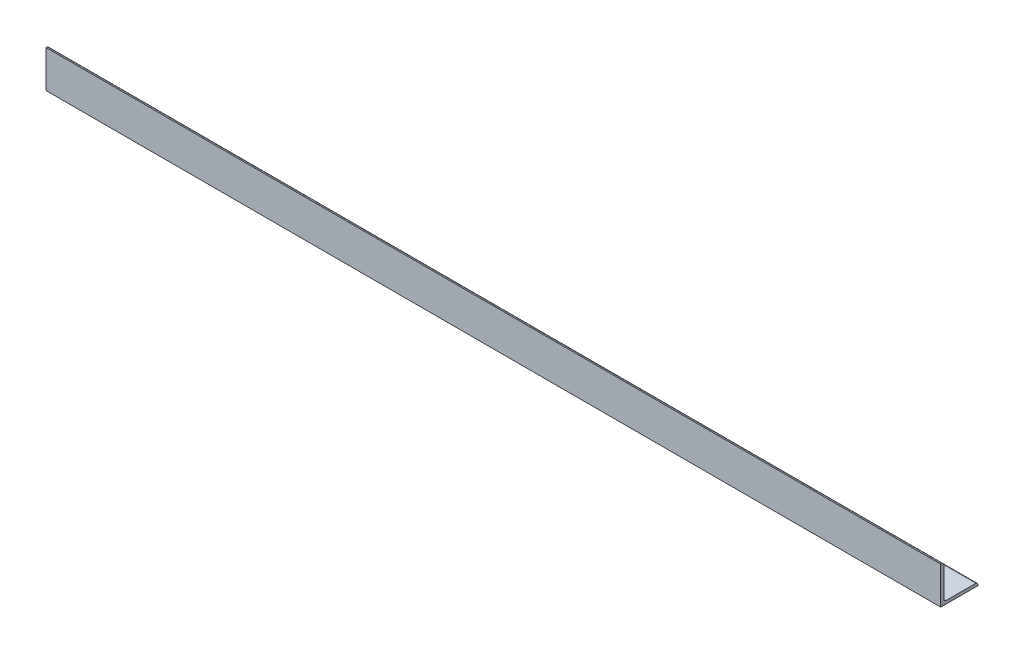
ISO-10303-21;
HEADER;
FILE_DESCRIPTION(('STEP AP214'),'2;1');
FILE_NAME('part.step','',(''),(''),'','','');
FILE_SCHEMA(('AUTOMOTIVE_DESIGN { 1 0 10303 214 1 1 1 1 }'));
ENDSEC;
DATA;
#1=APPLICATION_CONTEXT('core data for automotive mechanical design processes');
#2=APPLICATION_PROTOCOL_DEFINITION('international standard','automotive_design',2000,#1);
#3=PRODUCT_CONTEXT('',#1,'mechanical');
#4=PRODUCT('Part','Part','',(#3));
#5=PRODUCT_RELATED_PRODUCT_CATEGORY('part','',(#4));
#6=PRODUCT_DEFINITION_FORMATION('','',#4);
#7=PRODUCT_DEFINITION_CONTEXT('part definition',#1,'design');
#8=PRODUCT_DEFINITION('design','',#6,#7);
#9=PRODUCT_DEFINITION_SHAPE('','',#8);
#10=(LENGTH_UNIT() NAMED_UNIT(*) SI_UNIT(.MILLI.,.METRE.));
#11=(NAMED_UNIT(*) PLANE_ANGLE_UNIT() SI_UNIT($,.RADIAN.));
#12=(NAMED_UNIT(*) SI_UNIT($,.STERADIAN.) SOLID_ANGLE_UNIT());
#13=UNCERTAINTY_MEASURE_WITH_UNIT(LENGTH_MEASURE(1.E-05),#10,'distance_accuracy_value','');
#14=(GEOMETRIC_REPRESENTATION_CONTEXT(3) GLOBAL_UNCERTAINTY_ASSIGNED_CONTEXT((#13)) GLOBAL_UNIT_ASSIGNED_CONTEXT((#10,
#11,#12)) REPRESENTATION_CONTEXT('',''));
#15=CARTESIAN_POINT('',(0.,0.,0.));
#16=DIRECTION('',(0.,0.,1.));
#17=DIRECTION('',(1.,0.,0.));
#18=AXIS2_PLACEMENT_3D('',#15,#16,#17);
#19=CARTESIAN_POINT('',(-914.4,76.2,0.));
#20=DIRECTION('',(0.,1.,0.));
#21=DIRECTION('',(0.,0.,1.));
#22=AXIS2_PLACEMENT_3D('',#19,#20,#21);
#23=PLANE('',#22);
#24=DIRECTION('',(1.,0.,0.));
#25=VECTOR('',#24,1.);
#26=CARTESIAN_POINT('',(-914.4,76.2,0.));
#27=LINE('',#26,#25);
#28=CARTESIAN_POINT('',(-914.4,76.2,0.));
#29=VERTEX_POINT('',#28);
#30=CARTESIAN_POINT('',(914.4,76.2,0.));
#31=VERTEX_POINT('',#30);
#32=EDGE_CURVE('E41',#29,#31,#27,.T.);
#33=ORIENTED_EDGE('',*,*,#32,.T.);
#34=DIRECTION('',(0.,0.,1.));
#35=VECTOR('',#34,1.);
#36=CARTESIAN_POINT('',(914.4,76.2,0.));
#37=LINE('',#36,#35);
#38=CARTESIAN_POINT('',(914.4,76.2,-1.26999999999996));
#39=VERTEX_POINT('',#38);
#40=EDGE_CURVE('E121',#39,#31,#37,.T.);
#41=ORIENTED_EDGE('',*,*,#40,.F.);
#42=DIRECTION('',(1.,0.,0.));
#43=VECTOR('',#42,1.);
#44=CARTESIAN_POINT('',(-914.4,76.2,-1.26999999999996));
#45=LINE('',#44,#43);
#46=CARTESIAN_POINT('',(-914.4,76.2,-1.26999999999996));
#47=VERTEX_POINT('',#46);
#48=EDGE_CURVE('E11',#47,#39,#45,.T.);
#49=ORIENTED_EDGE('',*,*,#48,.F.);
#50=DIRECTION('',(0.,0.,1.));
#51=VECTOR('',#50,1.);
#52=CARTESIAN_POINT('',(-914.4,76.2,0.));
#53=LINE('',#52,#51);
#54=EDGE_CURVE('E122',#47,#29,#53,.T.);
#55=ORIENTED_EDGE('',*,*,#54,.T.);
#56=EDGE_LOOP('',(#33,#41,#49,#55));
#57=FACE_BOUND('',#56,.T.);
#58=ADVANCED_FACE('F38',(#57),#23,.T.);
#59=CARTESIAN_POINT('',(-914.4,71.12,-1.27));
#60=DIRECTION('',(1.,0.,0.));
#61=DIRECTION('',(0.,0.,-1.));
#62=AXIS2_PLACEMENT_3D('',#59,#60,#61);
#63=CYLINDRICAL_SURFACE('',#62,5.08);
#64=ORIENTED_EDGE('',*,*,#48,.T.);
#65=CARTESIAN_POINT('',(914.4,71.12,-1.27));
#66=DIRECTION('',(1.,0.,0.));
#67=DIRECTION('',(0.,0.,-1.));
#68=AXIS2_PLACEMENT_3D('',#65,#66,#67);
#69=CIRCLE('',#68,5.08);
#70=CARTESIAN_POINT('',(914.4,71.12,-6.35));
#71=VERTEX_POINT('',#70);
#72=EDGE_CURVE('E141',#71,#39,#69,.T.);
#73=ORIENTED_EDGE('',*,*,#72,.F.);
#74=DIRECTION('',(1.,0.,0.));
#75=VECTOR('',#74,1.);
#76=CARTESIAN_POINT('',(-914.4,71.12,-6.35));
#77=LINE('',#76,#75);
#78=CARTESIAN_POINT('',(-914.4,71.12,-6.35));
#79=VERTEX_POINT('',#78);
#80=EDGE_CURVE('E47',#79,#71,#77,.T.);
#81=ORIENTED_EDGE('',*,*,#80,.F.);
#82=CARTESIAN_POINT('',(-914.4,71.12,-1.27));
#83=DIRECTION('',(1.,0.,0.));
#84=DIRECTION('',(0.,0.,-1.));
#85=AXIS2_PLACEMENT_3D('',#82,#83,#84);
#86=CIRCLE('',#85,5.08);
#87=EDGE_CURVE('E128',#79,#47,#86,.T.);
#88=ORIENTED_EDGE('',*,*,#87,.T.);
#89=EDGE_LOOP('',(#64,#73,#81,#88));
#90=FACE_BOUND('',#89,.T.);
#91=ADVANCED_FACE('F236',(#90),#63,.T.);
#92=CARTESIAN_POINT('',(-914.4,71.12,-6.35));
#93=DIRECTION('',(0.,0.,-1.));
#94=DIRECTION('',(-1.,0.,0.));
#95=AXIS2_PLACEMENT_3D('',#92,#93,#94);
#96=PLANE('',#95);
#97=ORIENTED_EDGE('',*,*,#80,.T.);
#98=DIRECTION('',(0.,1.,0.));
#99=VECTOR('',#98,1.);
#100=CARTESIAN_POINT('',(914.4,71.12,-6.35));
#101=LINE('',#100,#99);
#102=CARTESIAN_POINT('',(914.4,11.43,-6.35));
#103=VERTEX_POINT('',#102);
#104=EDGE_CURVE('E159',#103,#71,#101,.T.);
#105=ORIENTED_EDGE('',*,*,#104,.F.);
#106=DIRECTION('',(1.,0.,0.));
#107=VECTOR('',#106,1.);
#108=CARTESIAN_POINT('',(-914.4,11.43,-6.35));
#109=LINE('',#108,#107);
#110=CARTESIAN_POINT('',(-914.4,11.43,-6.35));
#111=VERTEX_POINT('',#110);
#112=EDGE_CURVE('E195',#111,#103,#109,.T.);
#113=ORIENTED_EDGE('',*,*,#112,.F.);
#114=DIRECTION('',(0.,1.,0.));
#115=VECTOR('',#114,1.);
#116=CARTESIAN_POINT('',(-914.4,71.12,-6.35));
#117=LINE('',#116,#115);
#118=EDGE_CURVE('E188',#111,#79,#117,.T.);
#119=ORIENTED_EDGE('',*,*,#118,.T.);
#120=EDGE_LOOP('',(#97,#105,#113,#119));
#121=FACE_BOUND('',#120,.T.);
#122=ADVANCED_FACE('F234',(#121),#96,.T.);
#123=CARTESIAN_POINT('',(-914.4,11.43,-11.43));
#124=DIRECTION('',(1.,0.,0.));
#125=DIRECTION('',(0.,0.,-1.));
#126=AXIS2_PLACEMENT_3D('',#123,#124,#125);
#127=CYLINDRICAL_SURFACE('',#126,5.08);
#128=ORIENTED_EDGE('',*,*,#112,.T.);
#129=CARTESIAN_POINT('',(914.4,11.43,-11.43));
#130=DIRECTION('',(-1.,0.,0.));
#131=DIRECTION('',(0.,0.,-1.));
#132=AXIS2_PLACEMENT_3D('',#129,#130,#131);
#133=CIRCLE('',#132,5.08);
#134=CARTESIAN_POINT('',(914.4,6.35,-11.43));
#135=VERTEX_POINT('',#134);
#136=EDGE_CURVE('E156',#135,#103,#133,.T.);
#137=ORIENTED_EDGE('',*,*,#136,.F.);
#138=DIRECTION('',(1.,0.,0.));
#139=VECTOR('',#138,1.);
#140=CARTESIAN_POINT('',(-914.4,6.35,-11.43));
#141=LINE('',#140,#139);
#142=CARTESIAN_POINT('',(-914.4,6.35,-11.43));
#143=VERTEX_POINT('',#142);
#144=EDGE_CURVE('E198',#143,#135,#141,.T.);
#145=ORIENTED_EDGE('',*,*,#144,.F.);
#146=CARTESIAN_POINT('',(-914.4,11.43,-11.43));
#147=DIRECTION('',(-1.,0.,0.));
#148=DIRECTION('',(0.,0.,-1.));
#149=AXIS2_PLACEMENT_3D('',#146,#147,#148);
#150=CIRCLE('',#149,5.08);
#151=EDGE_CURVE('E184',#143,#111,#150,.T.);
#152=ORIENTED_EDGE('',*,*,#151,.T.);
#153=EDGE_LOOP('',(#128,#137,#145,#152));
#154=FACE_BOUND('',#153,.T.);
#155=ADVANCED_FACE('F232',(#154),#127,.F.);
#156=CARTESIAN_POINT('',(-914.4,6.35,-11.43));
#157=DIRECTION('',(0.,1.,0.));
#158=DIRECTION('',(0.,0.,1.));
#159=AXIS2_PLACEMENT_3D('',#156,#157,#158);
#160=PLANE('',#159);
#161=ORIENTED_EDGE('',*,*,#144,.T.);
#162=DIRECTION('',(0.,0.,1.));
#163=VECTOR('',#162,1.);
#164=CARTESIAN_POINT('',(914.4,6.35,-11.43));
#165=LINE('',#164,#163);
#166=CARTESIAN_POINT('',(914.4,6.35,-71.12));
#167=VERTEX_POINT('',#166);
#168=EDGE_CURVE('E153',#167,#135,#165,.T.);
#169=ORIENTED_EDGE('',*,*,#168,.F.);
#170=DIRECTION('',(1.,0.,0.));
#171=VECTOR('',#170,1.);
#172=CARTESIAN_POINT('',(-914.4,6.35,-71.12));
#173=LINE('',#172,#171);
#174=CARTESIAN_POINT('',(-914.4,6.35,-71.12));
#175=VERTEX_POINT('',#174);
#176=EDGE_CURVE('E201',#175,#167,#173,.T.);
#177=ORIENTED_EDGE('',*,*,#176,.F.);
#178=DIRECTION('',(0.,0.,1.));
#179=VECTOR('',#178,1.);
#180=CARTESIAN_POINT('',(-914.4,6.35,-11.43));
#181=LINE('',#180,#179);
#182=EDGE_CURVE('E180',#175,#143,#181,.T.);
#183=ORIENTED_EDGE('',*,*,#182,.T.);
#184=EDGE_LOOP('',(#161,#169,#177,#183));
#185=FACE_BOUND('',#184,.T.);
#186=ADVANCED_FACE('F227',(#185),#160,.T.);
#187=CARTESIAN_POINT('',(-914.4,1.27,-71.12));
#188=DIRECTION('',(1.,0.,0.));
#189=DIRECTION('',(0.,0.,-1.));
#190=AXIS2_PLACEMENT_3D('',#187,#188,#189);
#191=CYLINDRICAL_SURFACE('',#190,5.08);
#192=ORIENTED_EDGE('',*,*,#176,.T.);
#193=CARTESIAN_POINT('',(914.4,1.27,-71.12));
#194=DIRECTION('',(1.,0.,0.));
#195=DIRECTION('',(0.,0.,1.));
#196=AXIS2_PLACEMENT_3D('',#193,#194,#195);
#197=CIRCLE('',#196,5.08);
#198=CARTESIAN_POINT('',(914.4,1.26999999999996,-76.2));
#199=VERTEX_POINT('',#198);
#200=EDGE_CURVE('E150',#199,#167,#197,.T.);
#201=ORIENTED_EDGE('',*,*,#200,.F.);
#202=DIRECTION('',(1.,0.,0.));
#203=VECTOR('',#202,1.);
#204=CARTESIAN_POINT('',(-914.4,1.26999999999996,-76.2));
#205=LINE('',#204,#203);
#206=CARTESIAN_POINT('',(-914.4,1.26999999999996,-76.2));
#207=VERTEX_POINT('',#206);
#208=EDGE_CURVE('E204',#207,#199,#205,.T.);
#209=ORIENTED_EDGE('',*,*,#208,.F.);
#210=CARTESIAN_POINT('',(-914.4,1.27,-71.12));
#211=DIRECTION('',(1.,0.,0.));
#212=DIRECTION('',(0.,0.,1.));
#213=AXIS2_PLACEMENT_3D('',#210,#211,#212);
#214=CIRCLE('',#213,5.08);
#215=EDGE_CURVE('E176',#207,#175,#214,.T.);
#216=ORIENTED_EDGE('',*,*,#215,.T.);
#217=EDGE_LOOP('',(#192,#201,#209,#216));
#218=FACE_BOUND('',#217,.T.);
#219=ADVANCED_FACE('F220',(#218),#191,.T.);
#220=CARTESIAN_POINT('',(-914.4,1.26999999999996,-76.2));
#221=DIRECTION('',(0.,0.,-1.));
#222=DIRECTION('',(-1.,0.,0.));
#223=AXIS2_PLACEMENT_3D('',#220,#221,#222);
#224=PLANE('',#223);
#225=ORIENTED_EDGE('',*,*,#208,.T.);
#226=DIRECTION('',(0.,1.,0.));
#227=VECTOR('',#226,1.);
#228=CARTESIAN_POINT('',(914.4,1.26999999999996,-76.2));
#229=LINE('',#228,#227);
#230=CARTESIAN_POINT('',(914.4,0.,-76.2));
#231=VERTEX_POINT('',#230);
#232=EDGE_CURVE('E147',#231,#199,#229,.T.);
#233=ORIENTED_EDGE('',*,*,#232,.F.);
#234=DIRECTION('',(1.,0.,0.));
#235=VECTOR('',#234,1.);
#236=CARTESIAN_POINT('',(-914.4,0.,-76.2));
#237=LINE('',#236,#235);
#238=CARTESIAN_POINT('',(-914.4,0.,-76.2));
#239=VERTEX_POINT('',#238);
#240=EDGE_CURVE('E207',#239,#231,#237,.T.);
#241=ORIENTED_EDGE('',*,*,#240,.F.);
#242=DIRECTION('',(0.,1.,0.));
#243=VECTOR('',#242,1.);
#244=CARTESIAN_POINT('',(-914.4,1.26999999999996,-76.2));
#245=LINE('',#244,#243);
#246=EDGE_CURVE('E172',#239,#207,#245,.T.);
#247=ORIENTED_EDGE('',*,*,#246,.T.);
#248=EDGE_LOOP('',(#225,#233,#241,#247));
#249=FACE_BOUND('',#248,.T.);
#250=ADVANCED_FACE('F217',(#249),#224,.T.);
#251=CARTESIAN_POINT('',(-914.4,0.,0.));
#252=DIRECTION('',(0.,-1.,0.));
#253=DIRECTION('',(0.,0.,-1.));
#254=AXIS2_PLACEMENT_3D('',#251,#252,#253);
#255=PLANE('',#254);
#256=ORIENTED_EDGE('',*,*,#240,.T.);
#257=DIRECTION('',(0.,0.,-1.));
#258=VECTOR('',#257,1.);
#259=CARTESIAN_POINT('',(914.4,0.,0.));
#260=LINE('',#259,#258);
#261=CARTESIAN_POINT('',(914.4,0.,0.));
#262=VERTEX_POINT('',#261);
#263=EDGE_CURVE('E136',#262,#231,#260,.T.);
#264=ORIENTED_EDGE('',*,*,#263,.F.);
#265=DIRECTION('',(1.,0.,0.));
#266=VECTOR('',#265,1.);
#267=CARTESIAN_POINT('',(-914.4,0.,0.));
#268=LINE('',#267,#266);
#269=CARTESIAN_POINT('',(-914.4,0.,0.));
#270=VERTEX_POINT('',#269);
#271=EDGE_CURVE('E127',#270,#262,#268,.T.);
#272=ORIENTED_EDGE('',*,*,#271,.F.);
#273=DIRECTION('',(0.,0.,-1.));
#274=VECTOR('',#273,1.);
#275=CARTESIAN_POINT('',(-914.4,0.,0.));
#276=LINE('',#275,#274);
#277=EDGE_CURVE('E168',#270,#239,#276,.T.);
#278=ORIENTED_EDGE('',*,*,#277,.T.);
#279=EDGE_LOOP('',(#256,#264,#272,#278));
#280=FACE_BOUND('',#279,.T.);
#281=ADVANCED_FACE('F211',(#280),#255,.T.);
#282=CARTESIAN_POINT('',(-914.4,76.2,0.));
#283=DIRECTION('',(0.,0.,1.));
#284=DIRECTION('',(1.,0.,0.));
#285=AXIS2_PLACEMENT_3D('',#282,#283,#284);
#286=PLANE('',#285);
#287=ORIENTED_EDGE('',*,*,#271,.T.);
#288=DIRECTION('',(0.,-1.,0.));
#289=VECTOR('',#288,1.);
#290=CARTESIAN_POINT('',(914.4,76.2,0.));
#291=LINE('',#290,#289);
#292=EDGE_CURVE('E130',#31,#262,#291,.T.);
#293=ORIENTED_EDGE('',*,*,#292,.F.);
#294=ORIENTED_EDGE('',*,*,#32,.F.);
#295=DIRECTION('',(0.,-1.,0.));
#296=VECTOR('',#295,1.);
#297=CARTESIAN_POINT('',(-914.4,76.2,0.));
#298=LINE('',#297,#296);
#299=EDGE_CURVE('E165',#29,#270,#298,.T.);
#300=ORIENTED_EDGE('',*,*,#299,.T.);
#301=EDGE_LOOP('',(#287,#293,#294,#300));
#302=FACE_BOUND('',#301,.T.);
#303=ADVANCED_FACE('F131',(#302),#286,.T.);
#304=CARTESIAN_POINT('',(-914.4,71.12,-1.27));
#305=DIRECTION('',(1.,0.,0.));
#306=DIRECTION('',(0.,0.,-1.));
#307=AXIS2_PLACEMENT_3D('',#304,#305,#306);
#308=PLANE('',#307);
#309=ORIENTED_EDGE('',*,*,#54,.F.);
#310=ORIENTED_EDGE('',*,*,#87,.F.);
#311=ORIENTED_EDGE('',*,*,#118,.F.);
#312=ORIENTED_EDGE('',*,*,#151,.F.);
#313=ORIENTED_EDGE('',*,*,#182,.F.);
#314=ORIENTED_EDGE('',*,*,#215,.F.);
#315=ORIENTED_EDGE('',*,*,#246,.F.);
#316=ORIENTED_EDGE('',*,*,#277,.F.);
#317=ORIENTED_EDGE('',*,*,#299,.F.);
#318=EDGE_LOOP('',(#309,#310,#311,#312,#313,#314,#315,#316,#317));
#319=FACE_BOUND('',#318,.T.);
#320=ADVANCED_FACE('F223',(#319),#308,.F.);
#321=CARTESIAN_POINT('',(914.4,71.12,-1.27));
#322=DIRECTION('',(1.,0.,0.));
#323=DIRECTION('',(0.,0.,-1.));
#324=AXIS2_PLACEMENT_3D('',#321,#322,#323);
#325=PLANE('',#324);
#326=ORIENTED_EDGE('',*,*,#40,.T.);
#327=ORIENTED_EDGE('',*,*,#292,.T.);
#328=ORIENTED_EDGE('',*,*,#263,.T.);
#329=ORIENTED_EDGE('',*,*,#232,.T.);
#330=ORIENTED_EDGE('',*,*,#200,.T.);
#331=ORIENTED_EDGE('',*,*,#168,.T.);
#332=ORIENTED_EDGE('',*,*,#136,.T.);
#333=ORIENTED_EDGE('',*,*,#104,.T.);
#334=ORIENTED_EDGE('',*,*,#72,.T.);
#335=EDGE_LOOP('',(#326,#327,#328,#329,#330,#331,#332,#333,#334));
#336=FACE_BOUND('',#335,.T.);
#337=ADVANCED_FACE('F139',(#336),#325,.T.);
#338=CLOSED_SHELL('',(#58,#91,#122,#155,#186,#219,#250,#281,#303,#320,#337));
#339=MANIFOLD_SOLID_BREP('B2',#338);
#340=ADVANCED_BREP_SHAPE_REPRESENTATION('',(#18,#339),#14);
#341=SHAPE_DEFINITION_REPRESENTATION(#9,#340);
ENDSEC;
END-ISO-10303-21;
